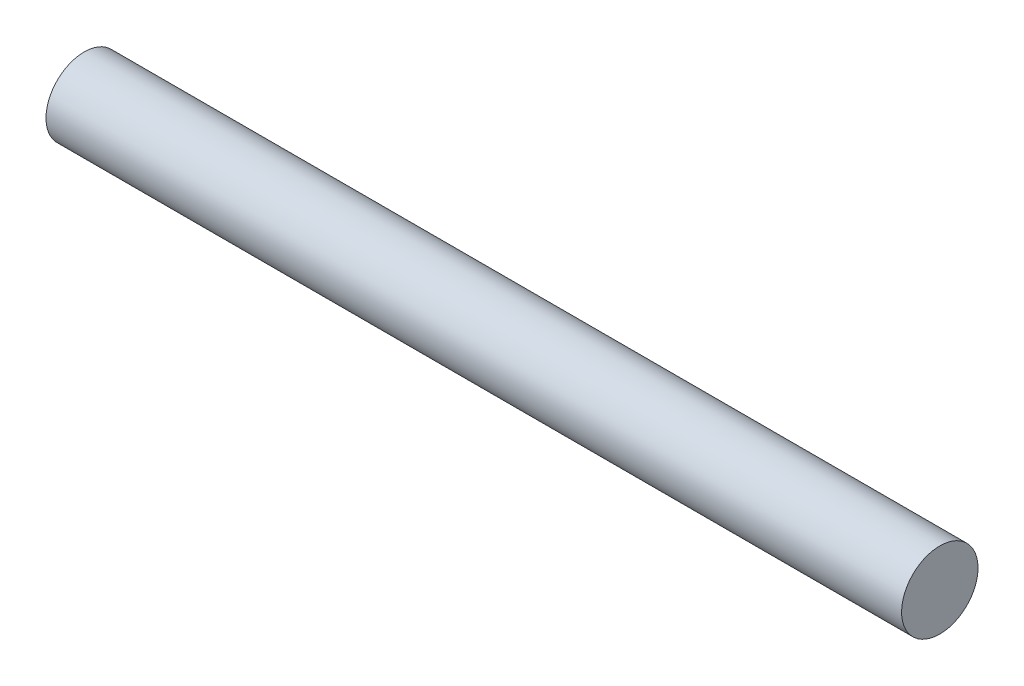
ISO-10303-21;
HEADER;
FILE_DESCRIPTION(('STEP AP214'),'2;1');
FILE_NAME('part.step','',(''),(''),'','','');
FILE_SCHEMA(('AUTOMOTIVE_DESIGN { 1 0 10303 214 1 1 1 1 }'));
ENDSEC;
DATA;
#1=APPLICATION_CONTEXT('core data for automotive mechanical design processes');
#2=APPLICATION_PROTOCOL_DEFINITION('international standard','automotive_design',2000,#1);
#3=PRODUCT_CONTEXT('',#1,'mechanical');
#4=PRODUCT('Part','Part','',(#3));
#5=PRODUCT_RELATED_PRODUCT_CATEGORY('part','',(#4));
#6=PRODUCT_DEFINITION_FORMATION('','',#4);
#7=PRODUCT_DEFINITION_CONTEXT('part definition',#1,'design');
#8=PRODUCT_DEFINITION('design','',#6,#7);
#9=PRODUCT_DEFINITION_SHAPE('','',#8);
#10=(LENGTH_UNIT() NAMED_UNIT(*) SI_UNIT(.MILLI.,.METRE.));
#11=(NAMED_UNIT(*) PLANE_ANGLE_UNIT() SI_UNIT($,.RADIAN.));
#12=(NAMED_UNIT(*) SI_UNIT($,.STERADIAN.) SOLID_ANGLE_UNIT());
#13=UNCERTAINTY_MEASURE_WITH_UNIT(LENGTH_MEASURE(1.E-05),#10,'distance_accuracy_value','');
#14=(GEOMETRIC_REPRESENTATION_CONTEXT(3) GLOBAL_UNCERTAINTY_ASSIGNED_CONTEXT((#13)) GLOBAL_UNIT_ASSIGNED_CONTEXT((#10,
#11,#12)) REPRESENTATION_CONTEXT('',''));
#15=CARTESIAN_POINT('',(0.,0.,0.));
#16=DIRECTION('',(0.,0.,1.));
#17=DIRECTION('',(1.,0.,0.));
#18=AXIS2_PLACEMENT_3D('',#15,#16,#17);
#19=CARTESIAN_POINT('',(90.6355122421383,0.,0.));
#20=DIRECTION('',(-1.,0.,0.));
#21=DIRECTION('',(0.,0.,1.));
#22=AXIS2_PLACEMENT_3D('',#19,#20,#21);
#23=CYLINDRICAL_SURFACE('',#22,6.34999999999999);
#24=CARTESIAN_POINT('',(71.0875,0.,0.));
#25=DIRECTION('',(-1.,0.,0.));
#26=DIRECTION('',(0.,-1.,0.));
#27=AXIS2_PLACEMENT_3D('',#24,#25,#26);
#28=CIRCLE('',#27,6.34999999999999);
#29=CARTESIAN_POINT('',(71.0875,-6.34999999999999,0.));
#30=VERTEX_POINT('',#29);
#31=EDGE_CURVE('E10',#30,#30,#28,.T.);
#32=ORIENTED_EDGE('',*,*,#31,.T.);
#33=EDGE_LOOP('',(#32));
#34=FACE_BOUND('',#33,.T.);
#35=CARTESIAN_POINT('',(-71.0875,0.,0.));
#36=DIRECTION('',(1.,0.,0.));
#37=DIRECTION('',(0.,1.,0.));
#38=AXIS2_PLACEMENT_3D('',#35,#36,#37);
#39=CIRCLE('',#38,6.34999999999999);
#40=CARTESIAN_POINT('',(-71.0875,6.34999999999999,0.));
#41=VERTEX_POINT('',#40);
#42=EDGE_CURVE('E40',#41,#41,#39,.F.);
#43=ORIENTED_EDGE('',*,*,#42,.F.);
#44=EDGE_LOOP('',(#43));
#45=FACE_BOUND('',#44,.T.);
#46=ADVANCED_FACE('F33',(#34,#45),#23,.T.);
#47=CARTESIAN_POINT('',(71.0875,6.35,0.));
#48=DIRECTION('',(-1.,0.,0.));
#49=DIRECTION('',(0.,1.,0.));
#50=AXIS2_PLACEMENT_3D('',#47,#48,#49);
#51=PLANE('',#50);
#52=ORIENTED_EDGE('',*,*,#31,.F.);
#53=EDGE_LOOP('',(#52));
#54=FACE_BOUND('',#53,.T.);
#55=ADVANCED_FACE('F52',(#54),#51,.F.);
#56=CARTESIAN_POINT('',(-71.0875,-6.35,0.));
#57=DIRECTION('',(1.,0.,0.));
#58=DIRECTION('',(0.,-1.,0.));
#59=AXIS2_PLACEMENT_3D('',#56,#57,#58);
#60=PLANE('',#59);
#61=ORIENTED_EDGE('',*,*,#42,.T.);
#62=EDGE_LOOP('',(#61));
#63=FACE_BOUND('',#62,.T.);
#64=ADVANCED_FACE('F49',(#63),#60,.F.);
#65=CLOSED_SHELL('',(#46,#55,#64));
#66=MANIFOLD_SOLID_BREP('B2',#65);
#67=ADVANCED_BREP_SHAPE_REPRESENTATION('',(#18,#66),#14);
#68=SHAPE_DEFINITION_REPRESENTATION(#9,#67);
ENDSEC;
END-ISO-10303-21;
